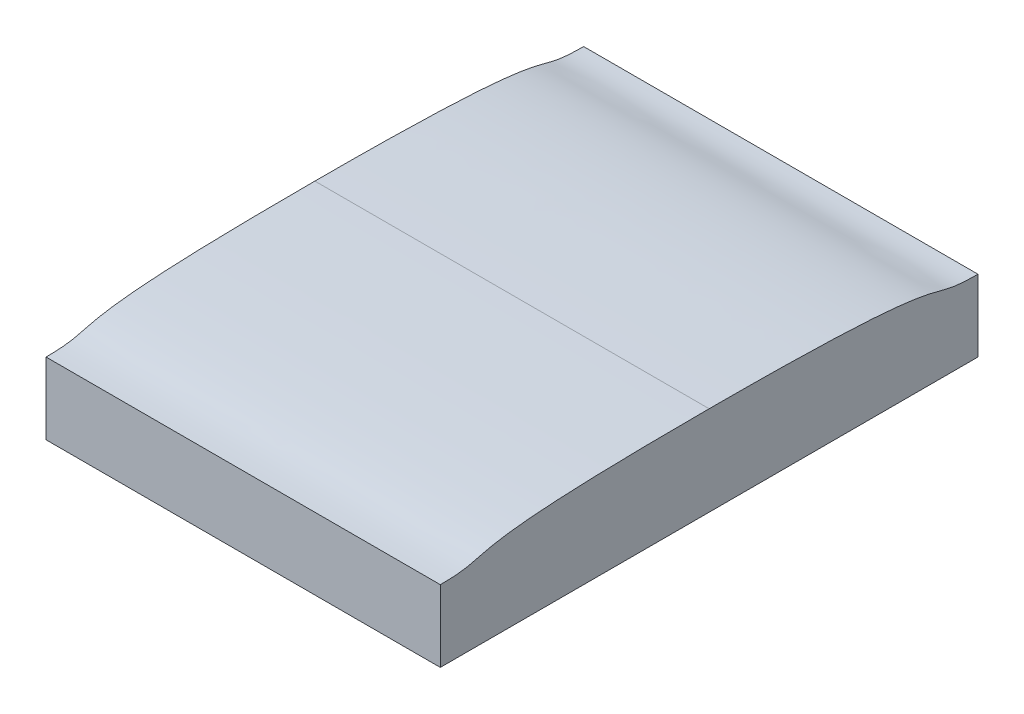
ISO-10303-21;
HEADER;
FILE_DESCRIPTION(('STEP AP214'),'2;1');
FILE_NAME('part.step','',(''),(''),'','','');
FILE_SCHEMA(('AUTOMOTIVE_DESIGN { 1 0 10303 214 1 1 1 1 }'));
ENDSEC;
DATA;
#1=APPLICATION_CONTEXT('core data for automotive mechanical design processes');
#2=APPLICATION_PROTOCOL_DEFINITION('international standard','automotive_design',2000,#1);
#3=PRODUCT_CONTEXT('',#1,'mechanical');
#4=PRODUCT('Part','Part','',(#3));
#5=PRODUCT_RELATED_PRODUCT_CATEGORY('part','',(#4));
#6=PRODUCT_DEFINITION_FORMATION('','',#4);
#7=PRODUCT_DEFINITION_CONTEXT('part definition',#1,'design');
#8=PRODUCT_DEFINITION('design','',#6,#7);
#9=PRODUCT_DEFINITION_SHAPE('','',#8);
#10=(LENGTH_UNIT() NAMED_UNIT(*) SI_UNIT(.MILLI.,.METRE.));
#11=(NAMED_UNIT(*) PLANE_ANGLE_UNIT() SI_UNIT($,.RADIAN.));
#12=(NAMED_UNIT(*) SI_UNIT($,.STERADIAN.) SOLID_ANGLE_UNIT());
#13=UNCERTAINTY_MEASURE_WITH_UNIT(LENGTH_MEASURE(1.E-05),#10,'distance_accuracy_value','');
#14=(GEOMETRIC_REPRESENTATION_CONTEXT(3) GLOBAL_UNCERTAINTY_ASSIGNED_CONTEXT((#13)) GLOBAL_UNIT_ASSIGNED_CONTEXT((#10,
#11,#12)) REPRESENTATION_CONTEXT('',''));
#15=CARTESIAN_POINT('',(0.,0.,0.));
#16=DIRECTION('',(0.,0.,1.));
#17=DIRECTION('',(1.,0.,0.));
#18=AXIS2_PLACEMENT_3D('',#15,#16,#17);
#19=CARTESIAN_POINT('',(22.,-0.230657832531693,-15.));
#20=DIRECTION('',(0.,0.,1.));
#21=DIRECTION('',(0.,-1.,0.));
#22=AXIS2_PLACEMENT_3D('',#19,#20,#21);
#23=PLANE('',#22);
#24=DIRECTION('',(0.,1.,0.));
#25=VECTOR('',#24,1.);
#26=CARTESIAN_POINT('',(0.,-0.230657832531693,-15.));
#27=LINE('',#26,#25);
#28=CARTESIAN_POINT('',(0.,-0.230657832531693,-15.));
#29=VERTEX_POINT('',#28);
#30=CARTESIAN_POINT('',(0.,3.76934216746831,-15.));
#31=VERTEX_POINT('',#30);
#32=EDGE_CURVE('E129',#29,#31,#27,.T.);
#33=ORIENTED_EDGE('',*,*,#32,.T.);
#34=DIRECTION('',(-1.,0.,0.));
#35=VECTOR('',#34,1.);
#36=CARTESIAN_POINT('',(22.,3.76934216746831,-15.));
#37=LINE('',#36,#35);
#38=CARTESIAN_POINT('',(22.,3.76934216746831,-15.));
#39=VERTEX_POINT('',#38);
#40=EDGE_CURVE('E41',#39,#31,#37,.T.);
#41=ORIENTED_EDGE('',*,*,#40,.F.);
#42=DIRECTION('',(0.,1.,0.));
#43=VECTOR('',#42,1.);
#44=CARTESIAN_POINT('',(22.,-0.230657832531693,-15.));
#45=LINE('',#44,#43);
#46=CARTESIAN_POINT('',(22.,-0.230657832531693,-15.));
#47=VERTEX_POINT('',#46);
#48=EDGE_CURVE('E87',#47,#39,#45,.T.);
#49=ORIENTED_EDGE('',*,*,#48,.F.);
#50=DIRECTION('',(-1.,0.,0.));
#51=VECTOR('',#50,1.);
#52=CARTESIAN_POINT('',(22.,-0.230657832531693,-15.));
#53=LINE('',#52,#51);
#54=EDGE_CURVE('E11',#47,#29,#53,.T.);
#55=ORIENTED_EDGE('',*,*,#54,.T.);
#56=EDGE_LOOP('',(#33,#41,#49,#55));
#57=FACE_BOUND('',#56,.T.);
#58=ADVANCED_FACE('F33',(#57),#23,.F.);
#59=CARTESIAN_POINT('',(22.,3.76934216746831,-15.));
#60=CARTESIAN_POINT('',(22.,3.76934216746831,-11.4834720351897));
#61=CARTESIAN_POINT('',(22.,4.76934216746831,-14.9524614459049));
#62=CARTESIAN_POINT('',(22.,4.76934216746831,0.));
#63=B_SPLINE_CURVE_WITH_KNOTS('',3,(#59,#60,#61,#62),.UNSPECIFIED.,.F.,.F.,(4,4),(0.,1.),.UNSPECIFIED.);
#64=DIRECTION('',(-1.,0.,0.));
#65=VECTOR('',#64,1.);
#66=SURFACE_OF_LINEAR_EXTRUSION('',#63,#65);
#67=CARTESIAN_POINT('',(0.,3.76934216746831,-15.));
#68=CARTESIAN_POINT('',(0.,3.76934216746831,-11.4834720351897));
#69=CARTESIAN_POINT('',(0.,4.76934216746831,-14.9524614459049));
#70=CARTESIAN_POINT('',(0.,4.76934216746831,0.));
#71=B_SPLINE_CURVE_WITH_KNOTS('',3,(#67,#68,#69,#70),.UNSPECIFIED.,.F.,.F.,(4,4),(0.,1.),.UNSPECIFIED.);
#72=CARTESIAN_POINT('',(0.,4.76934216746831,0.));
#73=VERTEX_POINT('',#72);
#74=EDGE_CURVE('E134',#31,#73,#71,.T.);
#75=ORIENTED_EDGE('',*,*,#74,.T.);
#76=DIRECTION('',(-1.,0.,0.));
#77=VECTOR('',#76,1.);
#78=CARTESIAN_POINT('',(22.,4.76934216746831,0.));
#79=LINE('',#78,#77);
#80=CARTESIAN_POINT('',(22.,4.76934216746831,0.));
#81=VERTEX_POINT('',#80);
#82=EDGE_CURVE('E109',#81,#73,#79,.T.);
#83=ORIENTED_EDGE('',*,*,#82,.F.);
#84=EDGE_CURVE('E100',#39,#81,#63,.T.);
#85=ORIENTED_EDGE('',*,*,#84,.F.);
#86=ORIENTED_EDGE('',*,*,#40,.T.);
#87=EDGE_LOOP('',(#75,#83,#85,#86));
#88=FACE_BOUND('',#87,.T.);
#89=ADVANCED_FACE('F159',(#88),#66,.F.);
#90=CARTESIAN_POINT('',(22.,4.76934216746831,0.));
#91=CARTESIAN_POINT('',(22.,4.76934216746831,14.9524614459049));
#92=CARTESIAN_POINT('',(22.,3.76934216746831,11.4834720351897));
#93=CARTESIAN_POINT('',(22.,3.76934216746831,15.));
#94=B_SPLINE_CURVE_WITH_KNOTS('',3,(#90,#91,#92,#93),.UNSPECIFIED.,.F.,.F.,(4,4),(0.,1.),.UNSPECIFIED.);
#95=DIRECTION('',(-1.,0.,0.));
#96=VECTOR('',#95,1.);
#97=SURFACE_OF_LINEAR_EXTRUSION('',#94,#96);
#98=CARTESIAN_POINT('',(0.,4.76934216746831,0.));
#99=CARTESIAN_POINT('',(0.,4.76934216746831,14.9524614459049));
#100=CARTESIAN_POINT('',(0.,3.76934216746831,11.4834720351897));
#101=CARTESIAN_POINT('',(0.,3.76934216746831,15.));
#102=B_SPLINE_CURVE_WITH_KNOTS('',3,(#98,#99,#100,#101),.UNSPECIFIED.,.F.,.F.,(4,4),(0.,1.),.UNSPECIFIED.);
#103=CARTESIAN_POINT('',(0.,3.76934216746831,15.));
#104=VERTEX_POINT('',#103);
#105=EDGE_CURVE('E108',#73,#104,#102,.T.);
#106=ORIENTED_EDGE('',*,*,#105,.T.);
#107=DIRECTION('',(-1.,0.,0.));
#108=VECTOR('',#107,1.);
#109=CARTESIAN_POINT('',(22.,3.76934216746831,15.));
#110=LINE('',#109,#108);
#111=CARTESIAN_POINT('',(22.,3.76934216746831,15.));
#112=VERTEX_POINT('',#111);
#113=EDGE_CURVE('E105',#112,#104,#110,.T.);
#114=ORIENTED_EDGE('',*,*,#113,.F.);
#115=EDGE_CURVE('E94',#81,#112,#94,.T.);
#116=ORIENTED_EDGE('',*,*,#115,.F.);
#117=ORIENTED_EDGE('',*,*,#82,.T.);
#118=EDGE_LOOP('',(#106,#114,#116,#117));
#119=FACE_BOUND('',#118,.T.);
#120=ADVANCED_FACE('F106',(#119),#97,.F.);
#121=CARTESIAN_POINT('',(22.,-0.230657832531694,15.));
#122=DIRECTION('',(0.,0.,-1.));
#123=DIRECTION('',(0.,1.,0.));
#124=AXIS2_PLACEMENT_3D('',#121,#122,#123);
#125=PLANE('',#124);
#126=DIRECTION('',(0.,-1.,0.));
#127=VECTOR('',#126,1.);
#128=CARTESIAN_POINT('',(0.,-0.230657832531694,15.));
#129=LINE('',#128,#127);
#130=CARTESIAN_POINT('',(0.,-0.230657832531694,15.));
#131=VERTEX_POINT('',#130);
#132=EDGE_CURVE('E72',#104,#131,#129,.T.);
#133=ORIENTED_EDGE('',*,*,#132,.T.);
#134=DIRECTION('',(-1.,0.,0.));
#135=VECTOR('',#134,1.);
#136=CARTESIAN_POINT('',(22.,-0.230657832531694,15.));
#137=LINE('',#136,#135);
#138=CARTESIAN_POINT('',(22.,-0.230657832531694,15.));
#139=VERTEX_POINT('',#138);
#140=EDGE_CURVE('E110',#139,#131,#137,.T.);
#141=ORIENTED_EDGE('',*,*,#140,.F.);
#142=DIRECTION('',(0.,-1.,0.));
#143=VECTOR('',#142,1.);
#144=CARTESIAN_POINT('',(22.,-0.230657832531694,15.));
#145=LINE('',#144,#143);
#146=EDGE_CURVE('E98',#112,#139,#145,.T.);
#147=ORIENTED_EDGE('',*,*,#146,.F.);
#148=ORIENTED_EDGE('',*,*,#113,.T.);
#149=EDGE_LOOP('',(#133,#141,#147,#148));
#150=FACE_BOUND('',#149,.T.);
#151=ADVANCED_FACE('F112',(#150),#125,.F.);
#152=CARTESIAN_POINT('',(22.,-0.230657832531694,15.));
#153=DIRECTION('',(0.,1.,0.));
#154=DIRECTION('',(0.,0.,1.));
#155=AXIS2_PLACEMENT_3D('',#152,#153,#154);
#156=PLANE('',#155);
#157=CARTESIAN_POINT('',(0.,-0.230657832531694,15.));
#158=CARTESIAN_POINT('',(0.,-0.230657832531694,10.3898885205619));
#159=CARTESIAN_POINT('',(0.,-0.230657832531693,8.66909228599543));
#160=CARTESIAN_POINT('',(0.,-0.230657832531693,0.));
#161=B_SPLINE_CURVE_WITH_KNOTS('',3,(#157,#158,#159,#160),.UNSPECIFIED.,.F.,.F.,(4,4),(0.,1.),.UNSPECIFIED.);
#162=CARTESIAN_POINT('',(0.,-0.230657832531693,0.));
#163=VERTEX_POINT('',#162);
#164=EDGE_CURVE('E79',#131,#163,#161,.T.);
#165=ORIENTED_EDGE('',*,*,#164,.T.);
#166=CARTESIAN_POINT('',(0.,-0.230657832531693,0.));
#167=CARTESIAN_POINT('',(0.,-0.230657832531693,-8.66909228599543));
#168=CARTESIAN_POINT('',(0.,-0.230657832531694,-10.3898885205619));
#169=CARTESIAN_POINT('',(0.,-0.230657832531693,-15.));
#170=B_SPLINE_CURVE_WITH_KNOTS('',3,(#166,#167,#168,#169),.UNSPECIFIED.,.F.,.F.,(4,4),(0.,1.),.UNSPECIFIED.);
#171=EDGE_CURVE('E122',#163,#29,#170,.T.);
#172=ORIENTED_EDGE('',*,*,#171,.T.);
#173=ORIENTED_EDGE('',*,*,#54,.F.);
#174=CARTESIAN_POINT('',(22.,-0.230657832531693,0.));
#175=CARTESIAN_POINT('',(22.,-0.230657832531693,-8.66909228599543));
#176=CARTESIAN_POINT('',(22.,-0.230657832531694,-10.3898885205619));
#177=CARTESIAN_POINT('',(22.,-0.230657832531693,-15.));
#178=B_SPLINE_CURVE_WITH_KNOTS('',3,(#174,#175,#176,#177),.UNSPECIFIED.,.F.,.F.,(4,4),(0.,1.),.UNSPECIFIED.);
#179=CARTESIAN_POINT('',(22.,-0.230657832531693,0.));
#180=VERTEX_POINT('',#179);
#181=EDGE_CURVE('E151',#180,#47,#178,.T.);
#182=ORIENTED_EDGE('',*,*,#181,.F.);
#183=CARTESIAN_POINT('',(22.,-0.230657832531694,15.));
#184=CARTESIAN_POINT('',(22.,-0.230657832531694,10.3898885205619));
#185=CARTESIAN_POINT('',(22.,-0.230657832531693,8.66909228599543));
#186=CARTESIAN_POINT('',(22.,-0.230657832531693,0.));
#187=B_SPLINE_CURVE_WITH_KNOTS('',3,(#183,#184,#185,#186),.UNSPECIFIED.,.F.,.F.,(4,4),(0.,1.),.UNSPECIFIED.);
#188=EDGE_CURVE('E49',#139,#180,#187,.T.);
#189=ORIENTED_EDGE('',*,*,#188,.F.);
#190=ORIENTED_EDGE('',*,*,#140,.T.);
#191=EDGE_LOOP('',(#165,#172,#173,#182,#189,#190));
#192=FACE_BOUND('',#191,.T.);
#193=ADVANCED_FACE('F163',(#192),#156,.F.);
#194=CARTESIAN_POINT('',(22.,4.26934216746831,11.7884750554105));
#195=DIRECTION('',(-1.,0.,0.));
#196=DIRECTION('',(0.,0.,1.));
#197=AXIS2_PLACEMENT_3D('',#194,#195,#196);
#198=PLANE('',#197);
#199=ORIENTED_EDGE('',*,*,#181,.T.);
#200=ORIENTED_EDGE('',*,*,#48,.T.);
#201=ORIENTED_EDGE('',*,*,#84,.T.);
#202=ORIENTED_EDGE('',*,*,#115,.T.);
#203=ORIENTED_EDGE('',*,*,#146,.T.);
#204=ORIENTED_EDGE('',*,*,#188,.T.);
#205=EDGE_LOOP('',(#199,#200,#201,#202,#203,#204));
#206=FACE_BOUND('',#205,.T.);
#207=ADVANCED_FACE('F96',(#206),#198,.F.);
#208=CARTESIAN_POINT('',(0.,4.26934216746831,11.7884750554105));
#209=DIRECTION('',(-1.,0.,0.));
#210=DIRECTION('',(0.,0.,1.));
#211=AXIS2_PLACEMENT_3D('',#208,#209,#210);
#212=PLANE('',#211);
#213=ORIENTED_EDGE('',*,*,#171,.F.);
#214=ORIENTED_EDGE('',*,*,#164,.F.);
#215=ORIENTED_EDGE('',*,*,#132,.F.);
#216=ORIENTED_EDGE('',*,*,#105,.F.);
#217=ORIENTED_EDGE('',*,*,#74,.F.);
#218=ORIENTED_EDGE('',*,*,#32,.F.);
#219=EDGE_LOOP('',(#213,#214,#215,#216,#217,#218));
#220=FACE_BOUND('',#219,.T.);
#221=ADVANCED_FACE('F161',(#220),#212,.T.);
#222=CLOSED_SHELL('',(#58,#89,#120,#151,#193,#207,#221));
#223=MANIFOLD_SOLID_BREP('B2',#222);
#224=ADVANCED_BREP_SHAPE_REPRESENTATION('',(#18,#223),#14);
#225=SHAPE_DEFINITION_REPRESENTATION(#9,#224);
ENDSEC;
END-ISO-10303-21;
